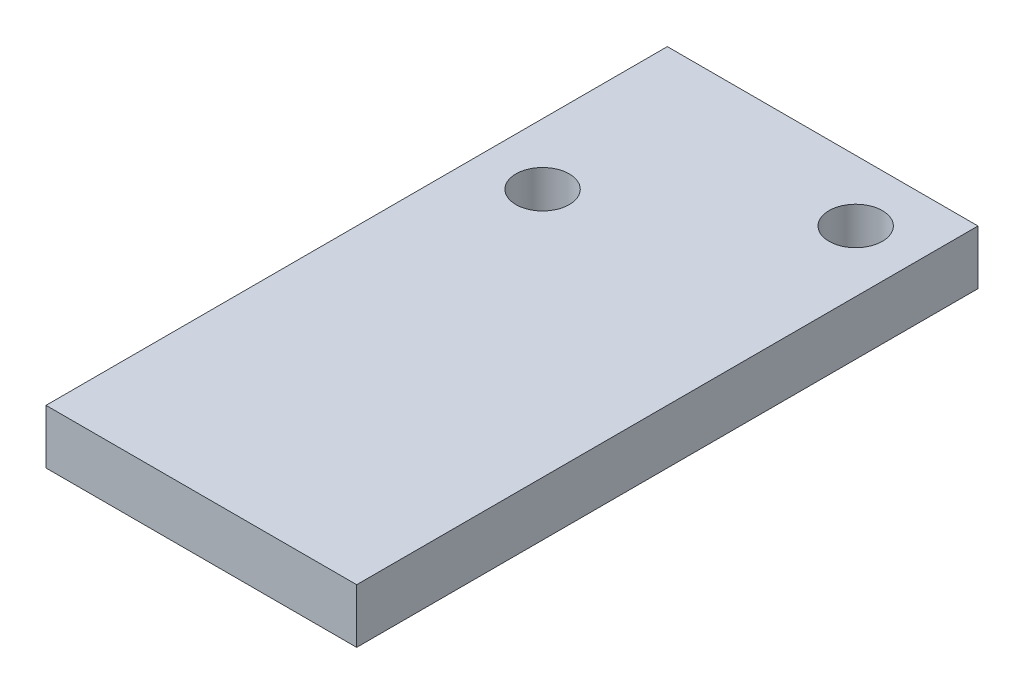
ISO-10303-21;
HEADER;
FILE_DESCRIPTION(('STEP AP214'),'2;1');
FILE_NAME('part.step','',(''),(''),'','','');
FILE_SCHEMA(('AUTOMOTIVE_DESIGN { 1 0 10303 214 1 1 1 1 }'));
ENDSEC;
DATA;
#1=APPLICATION_CONTEXT('core data for automotive mechanical design processes');
#2=APPLICATION_PROTOCOL_DEFINITION('international standard','automotive_design',2000,#1);
#3=PRODUCT_CONTEXT('',#1,'mechanical');
#4=PRODUCT('Part','Part','',(#3));
#5=PRODUCT_RELATED_PRODUCT_CATEGORY('part','',(#4));
#6=PRODUCT_DEFINITION_FORMATION('','',#4);
#7=PRODUCT_DEFINITION_CONTEXT('part definition',#1,'design');
#8=PRODUCT_DEFINITION('design','',#6,#7);
#9=PRODUCT_DEFINITION_SHAPE('','',#8);
#10=(LENGTH_UNIT() NAMED_UNIT(*) SI_UNIT(.MILLI.,.METRE.));
#11=(NAMED_UNIT(*) PLANE_ANGLE_UNIT() SI_UNIT($,.RADIAN.));
#12=(NAMED_UNIT(*) SI_UNIT($,.STERADIAN.) SOLID_ANGLE_UNIT());
#13=UNCERTAINTY_MEASURE_WITH_UNIT(LENGTH_MEASURE(1.E-05),#10,'distance_accuracy_value','');
#14=(GEOMETRIC_REPRESENTATION_CONTEXT(3) GLOBAL_UNCERTAINTY_ASSIGNED_CONTEXT((#13)) GLOBAL_UNIT_ASSIGNED_CONTEXT((#10,
#11,#12)) REPRESENTATION_CONTEXT('',''));
#15=CARTESIAN_POINT('',(0.,0.,0.));
#16=DIRECTION('',(0.,0.,1.));
#17=DIRECTION('',(1.,0.,0.));
#18=AXIS2_PLACEMENT_3D('',#15,#16,#17);
#19=CARTESIAN_POINT('',(0.,2.22,0.));
#20=DIRECTION('',(0.,-1.,0.));
#21=DIRECTION('',(0.,0.,-1.));
#22=AXIS2_PLACEMENT_3D('',#19,#20,#21);
#23=PLANE('',#22);
#24=DIRECTION('',(0.,0.,1.));
#25=VECTOR('',#24,1.);
#26=CARTESIAN_POINT('',(0.,2.22,0.));
#27=LINE('',#26,#25);
#28=CARTESIAN_POINT('',(0.,2.22,-25.4));
#29=VERTEX_POINT('',#28);
#30=CARTESIAN_POINT('',(0.,2.22,0.));
#31=VERTEX_POINT('',#30);
#32=EDGE_CURVE('E98',#29,#31,#27,.T.);
#33=ORIENTED_EDGE('',*,*,#32,.T.);
#34=DIRECTION('',(1.,0.,0.));
#35=VECTOR('',#34,1.);
#36=CARTESIAN_POINT('',(0.,2.22,0.));
#37=LINE('',#36,#35);
#38=CARTESIAN_POINT('',(12.7,2.22,0.));
#39=VERTEX_POINT('',#38);
#40=EDGE_CURVE('E93',#31,#39,#37,.T.);
#41=ORIENTED_EDGE('',*,*,#40,.T.);
#42=DIRECTION('',(0.,0.,-1.));
#43=VECTOR('',#42,1.);
#44=CARTESIAN_POINT('',(12.7,2.22,0.));
#45=LINE('',#44,#43);
#46=CARTESIAN_POINT('',(12.7,2.22,-25.4));
#47=VERTEX_POINT('',#46);
#48=EDGE_CURVE('E96',#39,#47,#45,.T.);
#49=ORIENTED_EDGE('',*,*,#48,.T.);
#50=DIRECTION('',(-1.,0.,0.));
#51=VECTOR('',#50,1.);
#52=CARTESIAN_POINT('',(0.,2.22,-25.4));
#53=LINE('',#52,#51);
#54=EDGE_CURVE('E63',#47,#29,#53,.T.);
#55=ORIENTED_EDGE('',*,*,#54,.T.);
#56=EDGE_LOOP('',(#33,#41,#49,#55));
#57=FACE_BOUND('',#56,.T.);
#58=CARTESIAN_POINT('',(2.5,2.22,-17.8));
#59=DIRECTION('',(0.,1.,0.));
#60=DIRECTION('',(0.,0.,1.));
#61=AXIS2_PLACEMENT_3D('',#58,#59,#60);
#62=CIRCLE('',#61,1.09);
#63=CARTESIAN_POINT('',(2.5,2.22,-16.71));
#64=VERTEX_POINT('',#63);
#65=EDGE_CURVE('E118',#64,#64,#62,.T.);
#66=ORIENTED_EDGE('',*,*,#65,.F.);
#67=EDGE_LOOP('',(#66));
#68=FACE_BOUND('',#67,.T.);
#69=CARTESIAN_POINT('',(10.2,2.22,-22.9));
#70=DIRECTION('',(0.,1.,0.));
#71=DIRECTION('',(0.,0.,1.));
#72=AXIS2_PLACEMENT_3D('',#69,#70,#71);
#73=CIRCLE('',#72,1.09);
#74=CARTESIAN_POINT('',(10.2,2.22,-21.81));
#75=VERTEX_POINT('',#74);
#76=EDGE_CURVE('E140',#75,#75,#73,.T.);
#77=ORIENTED_EDGE('',*,*,#76,.F.);
#78=EDGE_LOOP('',(#77));
#79=FACE_BOUND('',#78,.T.);
#80=ADVANCED_FACE('F45',(#57,#68,#79),#23,.F.);
#81=CARTESIAN_POINT('',(0.,0.,0.));
#82=DIRECTION('',(0.,-1.,0.));
#83=DIRECTION('',(0.,0.,-1.));
#84=AXIS2_PLACEMENT_3D('',#81,#82,#83);
#85=PLANE('',#84);
#86=CARTESIAN_POINT('',(2.5,0.,-17.8));
#87=DIRECTION('',(0.,1.,0.));
#88=DIRECTION('',(0.,0.,1.));
#89=AXIS2_PLACEMENT_3D('',#86,#87,#88);
#90=CIRCLE('',#89,1.09);
#91=CARTESIAN_POINT('',(2.5,0.,-16.71));
#92=VERTEX_POINT('',#91);
#93=EDGE_CURVE('E136',#92,#92,#90,.T.);
#94=ORIENTED_EDGE('',*,*,#93,.T.);
#95=EDGE_LOOP('',(#94));
#96=FACE_BOUND('',#95,.T.);
#97=DIRECTION('',(0.,0.,1.));
#98=VECTOR('',#97,1.);
#99=CARTESIAN_POINT('',(0.,0.,0.));
#100=LINE('',#99,#98);
#101=CARTESIAN_POINT('',(0.,0.,-25.4));
#102=VERTEX_POINT('',#101);
#103=CARTESIAN_POINT('',(0.,0.,0.));
#104=VERTEX_POINT('',#103);
#105=EDGE_CURVE('E114',#102,#104,#100,.T.);
#106=ORIENTED_EDGE('',*,*,#105,.F.);
#107=DIRECTION('',(-1.,0.,0.));
#108=VECTOR('',#107,1.);
#109=CARTESIAN_POINT('',(0.,0.,-25.4));
#110=LINE('',#109,#108);
#111=CARTESIAN_POINT('',(12.7,0.,-25.4));
#112=VERTEX_POINT('',#111);
#113=EDGE_CURVE('E86',#112,#102,#110,.T.);
#114=ORIENTED_EDGE('',*,*,#113,.F.);
#115=DIRECTION('',(0.,0.,-1.));
#116=VECTOR('',#115,1.);
#117=CARTESIAN_POINT('',(12.7,0.,0.));
#118=LINE('',#117,#116);
#119=CARTESIAN_POINT('',(12.7,0.,0.));
#120=VERTEX_POINT('',#119);
#121=EDGE_CURVE('E80',#120,#112,#118,.T.);
#122=ORIENTED_EDGE('',*,*,#121,.F.);
#123=DIRECTION('',(1.,0.,0.));
#124=VECTOR('',#123,1.);
#125=CARTESIAN_POINT('',(0.,0.,0.));
#126=LINE('',#125,#124);
#127=EDGE_CURVE('E103',#104,#120,#126,.T.);
#128=ORIENTED_EDGE('',*,*,#127,.F.);
#129=EDGE_LOOP('',(#106,#114,#122,#128));
#130=FACE_BOUND('',#129,.T.);
#131=CARTESIAN_POINT('',(10.2,0.,-22.9));
#132=DIRECTION('',(0.,1.,0.));
#133=DIRECTION('',(0.,0.,1.));
#134=AXIS2_PLACEMENT_3D('',#131,#132,#133);
#135=CIRCLE('',#134,1.09);
#136=CARTESIAN_POINT('',(10.2,0.,-21.81));
#137=VERTEX_POINT('',#136);
#138=EDGE_CURVE('E144',#137,#137,#135,.T.);
#139=ORIENTED_EDGE('',*,*,#138,.T.);
#140=EDGE_LOOP('',(#139));
#141=FACE_BOUND('',#140,.T.);
#142=ADVANCED_FACE('F131',(#96,#130,#141),#85,.T.);
#143=CARTESIAN_POINT('',(0.,2.22,0.));
#144=DIRECTION('',(1.,0.,0.));
#145=DIRECTION('',(0.,0.,-1.));
#146=AXIS2_PLACEMENT_3D('',#143,#144,#145);
#147=PLANE('',#146);
#148=ORIENTED_EDGE('',*,*,#105,.T.);
#149=DIRECTION('',(0.,-1.,0.));
#150=VECTOR('',#149,1.);
#151=CARTESIAN_POINT('',(0.,2.22,0.));
#152=LINE('',#151,#150);
#153=EDGE_CURVE('E11',#31,#104,#152,.T.);
#154=ORIENTED_EDGE('',*,*,#153,.F.);
#155=ORIENTED_EDGE('',*,*,#32,.F.);
#156=DIRECTION('',(0.,-1.,0.));
#157=VECTOR('',#156,1.);
#158=CARTESIAN_POINT('',(0.,2.22,-25.4));
#159=LINE('',#158,#157);
#160=EDGE_CURVE('E110',#29,#102,#159,.T.);
#161=ORIENTED_EDGE('',*,*,#160,.T.);
#162=EDGE_LOOP('',(#148,#154,#155,#161));
#163=FACE_BOUND('',#162,.T.);
#164=ADVANCED_FACE('F47',(#163),#147,.F.);
#165=CARTESIAN_POINT('',(0.,2.22,0.));
#166=DIRECTION('',(0.,0.,-1.));
#167=DIRECTION('',(-1.,0.,0.));
#168=AXIS2_PLACEMENT_3D('',#165,#166,#167);
#169=PLANE('',#168);
#170=ORIENTED_EDGE('',*,*,#127,.T.);
#171=DIRECTION('',(0.,-1.,0.));
#172=VECTOR('',#171,1.);
#173=CARTESIAN_POINT('',(12.7,2.22,0.));
#174=LINE('',#173,#172);
#175=EDGE_CURVE('E55',#39,#120,#174,.T.);
#176=ORIENTED_EDGE('',*,*,#175,.F.);
#177=ORIENTED_EDGE('',*,*,#40,.F.);
#178=ORIENTED_EDGE('',*,*,#153,.T.);
#179=EDGE_LOOP('',(#170,#176,#177,#178));
#180=FACE_BOUND('',#179,.T.);
#181=ADVANCED_FACE('F102',(#180),#169,.F.);
#182=CARTESIAN_POINT('',(12.7,2.22,0.));
#183=DIRECTION('',(-1.,0.,0.));
#184=DIRECTION('',(0.,0.,1.));
#185=AXIS2_PLACEMENT_3D('',#182,#183,#184);
#186=PLANE('',#185);
#187=ORIENTED_EDGE('',*,*,#121,.T.);
#188=DIRECTION('',(0.,-1.,0.));
#189=VECTOR('',#188,1.);
#190=CARTESIAN_POINT('',(12.7,2.22,-25.4));
#191=LINE('',#190,#189);
#192=EDGE_CURVE('E105',#47,#112,#191,.T.);
#193=ORIENTED_EDGE('',*,*,#192,.F.);
#194=ORIENTED_EDGE('',*,*,#48,.F.);
#195=ORIENTED_EDGE('',*,*,#175,.T.);
#196=EDGE_LOOP('',(#187,#193,#194,#195));
#197=FACE_BOUND('',#196,.T.);
#198=ADVANCED_FACE('F106',(#197),#186,.F.);
#199=CARTESIAN_POINT('',(0.,2.22,-25.4));
#200=DIRECTION('',(0.,0.,1.));
#201=DIRECTION('',(1.,0.,0.));
#202=AXIS2_PLACEMENT_3D('',#199,#200,#201);
#203=PLANE('',#202);
#204=ORIENTED_EDGE('',*,*,#113,.T.);
#205=ORIENTED_EDGE('',*,*,#160,.F.);
#206=ORIENTED_EDGE('',*,*,#54,.F.);
#207=ORIENTED_EDGE('',*,*,#192,.T.);
#208=EDGE_LOOP('',(#204,#205,#206,#207));
#209=FACE_BOUND('',#208,.T.);
#210=ADVANCED_FACE('F128',(#209),#203,.F.);
#211=CARTESIAN_POINT('',(2.5,2.22,-17.8));
#212=DIRECTION('',(0.,-1.,0.));
#213=DIRECTION('',(0.,0.,-1.));
#214=AXIS2_PLACEMENT_3D('',#211,#212,#213);
#215=CYLINDRICAL_SURFACE('',#214,1.09);
#216=ORIENTED_EDGE('',*,*,#65,.T.);
#217=EDGE_LOOP('',(#216));
#218=FACE_BOUND('',#217,.T.);
#219=ORIENTED_EDGE('',*,*,#93,.F.);
#220=EDGE_LOOP('',(#219));
#221=FACE_BOUND('',#220,.T.);
#222=ADVANCED_FACE('F163',(#218,#221),#215,.F.);
#223=CARTESIAN_POINT('',(10.2,2.22,-22.9));
#224=DIRECTION('',(0.,-1.,0.));
#225=DIRECTION('',(0.,0.,-1.));
#226=AXIS2_PLACEMENT_3D('',#223,#224,#225);
#227=CYLINDRICAL_SURFACE('',#226,1.09);
#228=ORIENTED_EDGE('',*,*,#76,.T.);
#229=EDGE_LOOP('',(#228));
#230=FACE_BOUND('',#229,.T.);
#231=ORIENTED_EDGE('',*,*,#138,.F.);
#232=EDGE_LOOP('',(#231));
#233=FACE_BOUND('',#232,.T.);
#234=ADVANCED_FACE('F152',(#230,#233),#227,.F.);
#235=CLOSED_SHELL('',(#80,#142,#164,#181,#198,#210,#222,#234));
#236=MANIFOLD_SOLID_BREP('B2',#235);
#237=ADVANCED_BREP_SHAPE_REPRESENTATION('',(#18,#236),#14);
#238=SHAPE_DEFINITION_REPRESENTATION(#9,#237);
ENDSEC;
END-ISO-10303-21;
